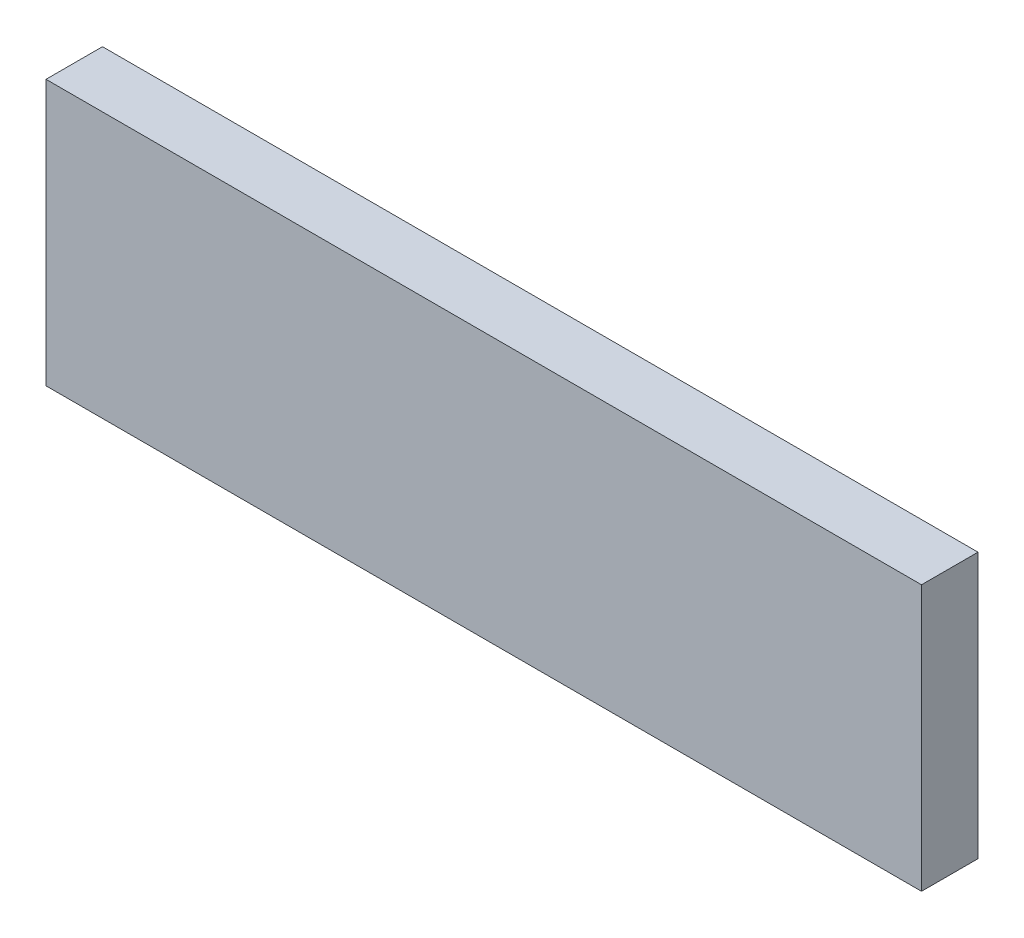
ISO-10303-21;
HEADER;
FILE_DESCRIPTION(('STEP AP214'),'2;1');
FILE_NAME('part.step','',(''),(''),'','','');
FILE_SCHEMA(('AUTOMOTIVE_DESIGN { 1 0 10303 214 1 1 1 1 }'));
ENDSEC;
DATA;
#1=APPLICATION_CONTEXT('core data for automotive mechanical design processes');
#2=APPLICATION_PROTOCOL_DEFINITION('international standard','automotive_design',2000,#1);
#3=PRODUCT_CONTEXT('',#1,'mechanical');
#4=PRODUCT('Part','Part','',(#3));
#5=PRODUCT_RELATED_PRODUCT_CATEGORY('part','',(#4));
#6=PRODUCT_DEFINITION_FORMATION('','',#4);
#7=PRODUCT_DEFINITION_CONTEXT('part definition',#1,'design');
#8=PRODUCT_DEFINITION('design','',#6,#7);
#9=PRODUCT_DEFINITION_SHAPE('','',#8);
#10=(LENGTH_UNIT() NAMED_UNIT(*) SI_UNIT(.MILLI.,.METRE.));
#11=(NAMED_UNIT(*) PLANE_ANGLE_UNIT() SI_UNIT($,.RADIAN.));
#12=(NAMED_UNIT(*) SI_UNIT($,.STERADIAN.) SOLID_ANGLE_UNIT());
#13=UNCERTAINTY_MEASURE_WITH_UNIT(LENGTH_MEASURE(1.E-05),#10,'distance_accuracy_value','');
#14=(GEOMETRIC_REPRESENTATION_CONTEXT(3) GLOBAL_UNCERTAINTY_ASSIGNED_CONTEXT((#13)) GLOBAL_UNIT_ASSIGNED_CONTEXT((#10,
#11,#12)) REPRESENTATION_CONTEXT('',''));
#15=CARTESIAN_POINT('',(0.,0.,0.));
#16=DIRECTION('',(0.,0.,1.));
#17=DIRECTION('',(1.,0.,0.));
#18=AXIS2_PLACEMENT_3D('',#15,#16,#17);
#19=CARTESIAN_POINT('',(0.,0.,10.));
#20=DIRECTION('',(1.,0.,0.));
#21=DIRECTION('',(0.,0.,-1.));
#22=AXIS2_PLACEMENT_3D('',#19,#20,#21);
#23=PLANE('',#22);
#24=DIRECTION('',(0.,-1.,0.));
#25=VECTOR('',#24,1.);
#26=CARTESIAN_POINT('',(0.,0.,0.));
#27=LINE('',#26,#25);
#28=CARTESIAN_POINT('',(0.,47.,0.));
#29=VERTEX_POINT('',#28);
#30=CARTESIAN_POINT('',(0.,0.,0.));
#31=VERTEX_POINT('',#30);
#32=EDGE_CURVE('E107',#29,#31,#27,.T.);
#33=ORIENTED_EDGE('',*,*,#32,.T.);
#34=DIRECTION('',(0.,0.,-1.));
#35=VECTOR('',#34,1.);
#36=CARTESIAN_POINT('',(0.,0.,10.));
#37=LINE('',#36,#35);
#38=CARTESIAN_POINT('',(0.,0.,10.));
#39=VERTEX_POINT('',#38);
#40=EDGE_CURVE('E11',#39,#31,#37,.T.);
#41=ORIENTED_EDGE('',*,*,#40,.F.);
#42=DIRECTION('',(0.,-1.,0.));
#43=VECTOR('',#42,1.);
#44=CARTESIAN_POINT('',(0.,0.,10.));
#45=LINE('',#44,#43);
#46=CARTESIAN_POINT('',(0.,47.,10.));
#47=VERTEX_POINT('',#46);
#48=EDGE_CURVE('E91',#47,#39,#45,.T.);
#49=ORIENTED_EDGE('',*,*,#48,.F.);
#50=DIRECTION('',(0.,0.,-1.));
#51=VECTOR('',#50,1.);
#52=CARTESIAN_POINT('',(0.,47.,10.));
#53=LINE('',#52,#51);
#54=EDGE_CURVE('E103',#47,#29,#53,.T.);
#55=ORIENTED_EDGE('',*,*,#54,.T.);
#56=EDGE_LOOP('',(#33,#41,#49,#55));
#57=FACE_BOUND('',#56,.T.);
#58=ADVANCED_FACE('F39',(#57),#23,.F.);
#59=CARTESIAN_POINT('',(0.,0.,10.));
#60=DIRECTION('',(0.,1.,0.));
#61=DIRECTION('',(0.,0.,1.));
#62=AXIS2_PLACEMENT_3D('',#59,#60,#61);
#63=PLANE('',#62);
#64=DIRECTION('',(1.,0.,0.));
#65=VECTOR('',#64,1.);
#66=CARTESIAN_POINT('',(0.,0.,0.));
#67=LINE('',#66,#65);
#68=CARTESIAN_POINT('',(155.,0.,0.));
#69=VERTEX_POINT('',#68);
#70=EDGE_CURVE('E96',#31,#69,#67,.T.);
#71=ORIENTED_EDGE('',*,*,#70,.T.);
#72=DIRECTION('',(0.,0.,-1.));
#73=VECTOR('',#72,1.);
#74=CARTESIAN_POINT('',(155.,0.,10.));
#75=LINE('',#74,#73);
#76=CARTESIAN_POINT('',(155.,0.,10.));
#77=VERTEX_POINT('',#76);
#78=EDGE_CURVE('E48',#77,#69,#75,.T.);
#79=ORIENTED_EDGE('',*,*,#78,.F.);
#80=DIRECTION('',(1.,0.,0.));
#81=VECTOR('',#80,1.);
#82=CARTESIAN_POINT('',(0.,0.,10.));
#83=LINE('',#82,#81);
#84=EDGE_CURVE('E86',#39,#77,#83,.T.);
#85=ORIENTED_EDGE('',*,*,#84,.F.);
#86=ORIENTED_EDGE('',*,*,#40,.T.);
#87=EDGE_LOOP('',(#71,#79,#85,#86));
#88=FACE_BOUND('',#87,.T.);
#89=ADVANCED_FACE('F95',(#88),#63,.F.);
#90=CARTESIAN_POINT('',(155.,0.,10.));
#91=DIRECTION('',(-1.,0.,0.));
#92=DIRECTION('',(0.,0.,1.));
#93=AXIS2_PLACEMENT_3D('',#90,#91,#92);
#94=PLANE('',#93);
#95=DIRECTION('',(0.,1.,0.));
#96=VECTOR('',#95,1.);
#97=CARTESIAN_POINT('',(155.,0.,0.));
#98=LINE('',#97,#96);
#99=CARTESIAN_POINT('',(155.,47.,0.));
#100=VERTEX_POINT('',#99);
#101=EDGE_CURVE('E73',#69,#100,#98,.T.);
#102=ORIENTED_EDGE('',*,*,#101,.T.);
#103=DIRECTION('',(0.,0.,-1.));
#104=VECTOR('',#103,1.);
#105=CARTESIAN_POINT('',(155.,47.,10.));
#106=LINE('',#105,#104);
#107=CARTESIAN_POINT('',(155.,47.,10.));
#108=VERTEX_POINT('',#107);
#109=EDGE_CURVE('E98',#108,#100,#106,.T.);
#110=ORIENTED_EDGE('',*,*,#109,.F.);
#111=DIRECTION('',(0.,1.,0.));
#112=VECTOR('',#111,1.);
#113=CARTESIAN_POINT('',(155.,0.,10.));
#114=LINE('',#113,#112);
#115=EDGE_CURVE('E89',#77,#108,#114,.T.);
#116=ORIENTED_EDGE('',*,*,#115,.F.);
#117=ORIENTED_EDGE('',*,*,#78,.T.);
#118=EDGE_LOOP('',(#102,#110,#116,#117));
#119=FACE_BOUND('',#118,.T.);
#120=ADVANCED_FACE('F99',(#119),#94,.F.);
#121=CARTESIAN_POINT('',(0.,47.,10.));
#122=DIRECTION('',(0.,-1.,0.));
#123=DIRECTION('',(0.,0.,-1.));
#124=AXIS2_PLACEMENT_3D('',#121,#122,#123);
#125=PLANE('',#124);
#126=DIRECTION('',(-1.,0.,0.));
#127=VECTOR('',#126,1.);
#128=CARTESIAN_POINT('',(0.,47.,0.));
#129=LINE('',#128,#127);
#130=EDGE_CURVE('E79',#100,#29,#129,.T.);
#131=ORIENTED_EDGE('',*,*,#130,.T.);
#132=ORIENTED_EDGE('',*,*,#54,.F.);
#133=DIRECTION('',(-1.,0.,0.));
#134=VECTOR('',#133,1.);
#135=CARTESIAN_POINT('',(0.,47.,10.));
#136=LINE('',#135,#134);
#137=EDGE_CURVE('E56',#108,#47,#136,.T.);
#138=ORIENTED_EDGE('',*,*,#137,.F.);
#139=ORIENTED_EDGE('',*,*,#109,.T.);
#140=EDGE_LOOP('',(#131,#132,#138,#139));
#141=FACE_BOUND('',#140,.T.);
#142=ADVANCED_FACE('F120',(#141),#125,.F.);
#143=CARTESIAN_POINT('',(0.,0.,10.));
#144=DIRECTION('',(0.,0.,-1.));
#145=DIRECTION('',(-1.,0.,0.));
#146=AXIS2_PLACEMENT_3D('',#143,#144,#145);
#147=PLANE('',#146);
#148=ORIENTED_EDGE('',*,*,#48,.T.);
#149=ORIENTED_EDGE('',*,*,#84,.T.);
#150=ORIENTED_EDGE('',*,*,#115,.T.);
#151=ORIENTED_EDGE('',*,*,#137,.T.);
#152=EDGE_LOOP('',(#148,#149,#150,#151));
#153=FACE_BOUND('',#152,.T.);
#154=ADVANCED_FACE('F87',(#153),#147,.F.);
#155=CARTESIAN_POINT('',(0.,0.,0.));
#156=DIRECTION('',(0.,0.,-1.));
#157=DIRECTION('',(-1.,0.,0.));
#158=AXIS2_PLACEMENT_3D('',#155,#156,#157);
#159=PLANE('',#158);
#160=ORIENTED_EDGE('',*,*,#32,.F.);
#161=ORIENTED_EDGE('',*,*,#130,.F.);
#162=ORIENTED_EDGE('',*,*,#101,.F.);
#163=ORIENTED_EDGE('',*,*,#70,.F.);
#164=EDGE_LOOP('',(#160,#161,#162,#163));
#165=FACE_BOUND('',#164,.T.);
#166=ADVANCED_FACE('F123',(#165),#159,.T.);
#167=CLOSED_SHELL('',(#58,#89,#120,#142,#154,#166));
#168=MANIFOLD_SOLID_BREP('B2',#167);
#169=ADVANCED_BREP_SHAPE_REPRESENTATION('',(#18,#168),#14);
#170=SHAPE_DEFINITION_REPRESENTATION(#9,#169);
ENDSEC;
END-ISO-10303-21;
